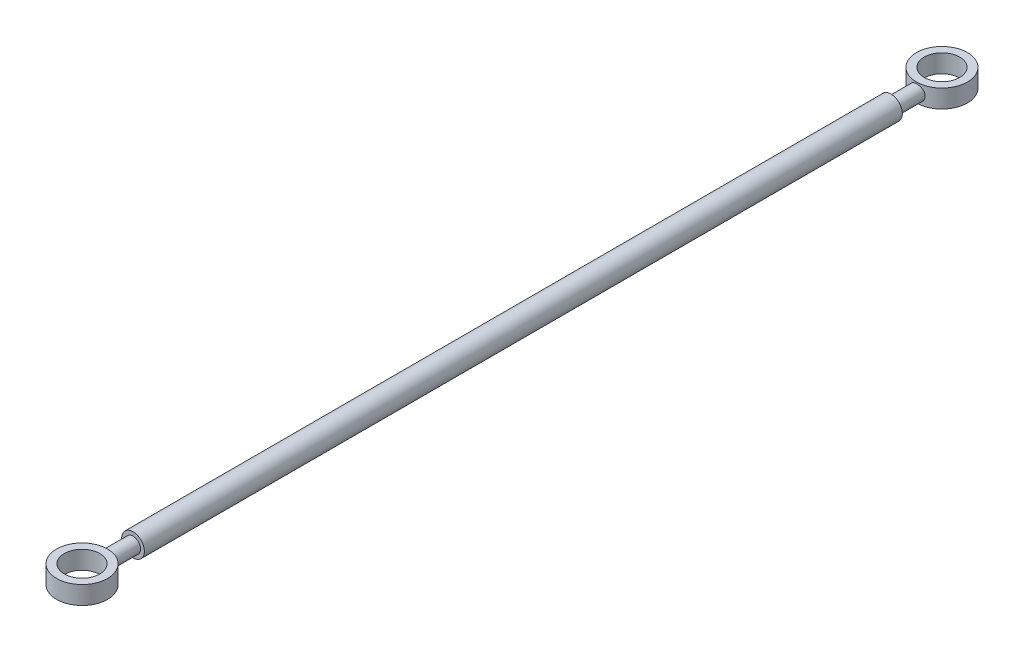
ISO-10303-21;
HEADER;
FILE_DESCRIPTION(('STEP AP214'),'2;1');
FILE_NAME('part.step','',(''),(''),'','','');
FILE_SCHEMA(('AUTOMOTIVE_DESIGN { 1 0 10303 214 1 1 1 1 }'));
ENDSEC;
DATA;
#1=APPLICATION_CONTEXT('core data for automotive mechanical design processes');
#2=APPLICATION_PROTOCOL_DEFINITION('international standard','automotive_design',2000,#1);
#3=PRODUCT_CONTEXT('',#1,'mechanical');
#4=PRODUCT('Part','Part','',(#3));
#5=PRODUCT_RELATED_PRODUCT_CATEGORY('part','',(#4));
#6=PRODUCT_DEFINITION_FORMATION('','',#4);
#7=PRODUCT_DEFINITION_CONTEXT('part definition',#1,'design');
#8=PRODUCT_DEFINITION('design','',#6,#7);
#9=PRODUCT_DEFINITION_SHAPE('','',#8);
#10=(LENGTH_UNIT() NAMED_UNIT(*) SI_UNIT(.MILLI.,.METRE.));
#11=(NAMED_UNIT(*) PLANE_ANGLE_UNIT() SI_UNIT($,.RADIAN.));
#12=(NAMED_UNIT(*) SI_UNIT($,.STERADIAN.) SOLID_ANGLE_UNIT());
#13=UNCERTAINTY_MEASURE_WITH_UNIT(LENGTH_MEASURE(1.E-05),#10,'distance_accuracy_value','');
#14=(GEOMETRIC_REPRESENTATION_CONTEXT(3) GLOBAL_UNCERTAINTY_ASSIGNED_CONTEXT((#13)) GLOBAL_UNIT_ASSIGNED_CONTEXT((#10,
#11,#12)) REPRESENTATION_CONTEXT('',''));
#15=CARTESIAN_POINT('',(0.,0.,0.));
#16=DIRECTION('',(0.,0.,1.));
#17=DIRECTION('',(1.,0.,0.));
#18=AXIS2_PLACEMENT_3D('',#15,#16,#17);
#19=CARTESIAN_POINT('',(0.,0.,5.95000000000001));
#20=DIRECTION('',(0.,0.,1.));
#21=DIRECTION('',(1.,0.,0.));
#22=AXIS2_PLACEMENT_3D('',#19,#20,#21);
#23=CYLINDRICAL_SURFACE('',#22,2.);
#24=CARTESIAN_POINT('',(0.,0.,213.45));
#25=DIRECTION('',(0.,0.,1.));
#26=DIRECTION('',(1.,0.,0.));
#27=AXIS2_PLACEMENT_3D('',#24,#25,#26);
#28=CIRCLE('',#27,2.);
#29=CARTESIAN_POINT('',(2.,0.,213.45));
#30=VERTEX_POINT('',#29);
#31=EDGE_CURVE('E10',#30,#30,#28,.F.);
#32=ORIENTED_EDGE('',*,*,#31,.F.);
#33=EDGE_LOOP('',(#32));
#34=FACE_BOUND('',#33,.T.);
#35=CARTESIAN_POINT('',(2.,0.,220.479281582253));
#36=CARTESIAN_POINT('',(1.99999851560738,0.109640870714026,220.479280366035));
#37=CARTESIAN_POINT('',(1.99095349170802,0.219296457513431,220.476442493243));
#38=CARTESIAN_POINT('',(1.95510353809183,0.435404942564613,220.46544201846));
#39=CARTESIAN_POINT('',(1.92829243842082,0.541856714736717,220.457277566623));
#40=CARTESIAN_POINT('',(1.85789863509272,0.74839798022177,220.43662863254));
#41=CARTESIAN_POINT('',(1.8143434668586,0.8484976063366,220.424151246243));
#42=CARTESIAN_POINT('',(1.71178806605942,1.03999290575109,220.396291888766));
#43=CARTESIAN_POINT('',(1.65278560842055,1.13138732253767,220.380909499229));
#44=CARTESIAN_POINT('',(1.5190460428306,1.30572023299706,220.348436845618));
#45=CARTESIAN_POINT('',(1.44391249598951,1.38834798079452,220.33131067637));
#46=CARTESIAN_POINT('',(1.28089334447942,1.54003606714713,220.297587124875));
#47=CARTESIAN_POINT('',(1.19300613086745,1.60909469129368,220.280989809669));
#48=CARTESIAN_POINT('',(1.00476841709437,1.73302917884108,220.249786772457));
#49=CARTESIAN_POINT('',(0.904201221694222,1.78758884956249,220.235228291808));
#50=CARTESIAN_POINT('',(0.69481291712832,1.87890181413536,220.210160003064));
#51=CARTESIAN_POINT('',(0.58599356142992,1.91565887859552,220.199649337735));
#52=CARTESIAN_POINT('',(0.366440327600565,1.96929673227082,220.184114985807));
#53=CARTESIAN_POINT('',(0.255846520120227,1.98670779177728,220.178945202559));
#54=CARTESIAN_POINT('',(0.0331947451205641,2.00283543386751,220.174160912561));
#55=CARTESIAN_POINT('',(-0.078862915228616,2.00155587741947,220.174545258479));
#56=CARTESIAN_POINT('',(-0.297543781955329,1.98069597961743,220.18072234133));
#57=CARTESIAN_POINT('',(-0.404227300094144,1.96168976313143,220.186345402318));
#58=CARTESIAN_POINT('',(-0.612815719991121,1.90685304982253,220.20216238028));
#59=CARTESIAN_POINT('',(-0.714720320723407,1.87102149472642,220.212356584765));
#60=CARTESIAN_POINT('',(-0.912231161223355,1.78315836788783,220.236406379095));
#61=CARTESIAN_POINT('',(-1.00775132084728,1.7309449285515,220.250302794915));
#62=CARTESIAN_POINT('',(-1.18885875631339,1.61194366841243,220.280281084691));
#63=CARTESIAN_POINT('',(-1.27444370107462,1.54515243779459,220.296363469622));
#64=CARTESIAN_POINT('',(-1.43667782212152,1.39590804115211,220.329710381038));
#65=CARTESIAN_POINT('',(-1.51286524763986,1.31295712424591,220.346996609429));
#66=CARTESIAN_POINT('',(-1.65037709434811,1.13528671287647,220.380268485835));
#67=CARTESIAN_POINT('',(-1.7117000910596,1.04056609182112,220.396254009104));
#68=CARTESIAN_POINT('',(-1.81821284350666,0.84084712084729,220.425216983731));
#69=CARTESIAN_POINT('',(-1.86324759780941,0.735761548860513,220.438165142782));
#70=CARTESIAN_POINT('',(-1.93484578229086,0.519023963553533,220.4592387343));
#71=CARTESIAN_POINT('',(-1.96141511599137,0.407374061287613,220.467365708012));
#72=CARTESIAN_POINT('',(-1.99447071211371,0.185065651450187,220.477539287428));
#73=CARTESIAN_POINT('',(-2.0016578148627,0.0745209720808633,220.479797968749));
#74=CARTESIAN_POINT('',(-1.99769994538114,-0.146197373587287,220.478565161083));
#75=CARTESIAN_POINT('',(-1.9865574864935,-0.25637108867696,220.475074460447));
#76=CARTESIAN_POINT('',(-1.94688045721304,-0.470315540046707,220.462944088212));
#77=CARTESIAN_POINT('',(-1.91879476281874,-0.574177829067012,220.454437431091));
#78=CARTESIAN_POINT('',(-1.84654768916541,-0.775709655385415,220.433370801785));
#79=CARTESIAN_POINT('',(-1.80238385719349,-0.873378245166763,220.420810211208));
#80=CARTESIAN_POINT('',(-1.69789727502947,-1.0626072968666,220.39263776731));
#81=CARTESIAN_POINT('',(-1.63717792174735,-1.15393779062483,220.376953978789));
#82=CARTESIAN_POINT('',(-1.50177654125562,-1.32536954846293,220.34445799054));
#83=CARTESIAN_POINT('',(-1.42709123044719,-1.40546816399984,220.327645526041));
#84=CARTESIAN_POINT('',(-1.26258732798229,-1.55521508114858,220.294033733161));
#85=CARTESIAN_POINT('',(-1.17231107986877,-1.62436711855155,220.277257903056));
#86=CARTESIAN_POINT('',(-0.981037336420591,-1.74655124272971,220.246236886566));
#87=CARTESIAN_POINT('',(-0.880040380408562,-1.79958413988639,220.231991572975));
#88=CARTESIAN_POINT('',(-0.670866929999853,-1.88751327306857,220.2077244725));
#89=CARTESIAN_POINT('',(-0.562751460230838,-1.92254552922692,220.197671121849));
#90=CARTESIAN_POINT('',(-0.341816042583998,-1.97383197269679,220.182781283523));
#91=CARTESIAN_POINT('',(-0.228997424541737,-1.99009143128261,220.177943331426));
#92=CARTESIAN_POINT('',(-0.00644828098169629,-2.0029755013884,220.174116930849));
#93=CARTESIAN_POINT('',(0.103237378208294,-2.00032041702638,220.174913884834));
#94=CARTESIAN_POINT('',(0.320532326668108,-1.97716864485407,220.181763637534));
#95=CARTESIAN_POINT('',(0.428141729855648,-1.95667293876499,220.187816147051));
#96=CARTESIAN_POINT('',(0.637142716306885,-1.89886466785401,220.20443721168));
#97=CARTESIAN_POINT('',(0.738587299967468,-1.8617291029875,220.214958175482));
#98=CARTESIAN_POINT('',(0.933859556384472,-1.77185335986215,220.239427506763));
#99=CARTESIAN_POINT('',(1.02768598670588,-1.71911064274097,220.253376431816));
#100=CARTESIAN_POINT('',(1.20827942056772,-1.59758502717247,220.28378196905));
#101=CARTESIAN_POINT('',(1.29472978502124,-1.5283480530679,220.300303879013));
#102=CARTESIAN_POINT('',(1.45502611913537,-1.37662053024966,220.333780183405));
#103=CARTESIAN_POINT('',(1.52886847405531,-1.29412619374,220.350734700267));
#104=CARTESIAN_POINT('',(1.66401147958099,-1.11534009923823,220.383737288877));
#105=CARTESIAN_POINT('',(1.72488397859197,-1.01871634220365,220.399744551877));
#106=CARTESIAN_POINT('',(1.8294484230846,-0.816146374987869,220.428392775536));
#107=CARTESIAN_POINT('',(1.87314888184387,-0.710204816199572,220.441035403254));
#108=CARTESIAN_POINT('',(1.93804172805924,-0.504286981297851,220.460230457429));
#109=CARTESIAN_POINT('',(1.96121288015267,-0.404979997528448,220.467307944032));
#110=CARTESIAN_POINT('',(1.99219123113458,-0.203785913515372,220.476833627253));
#111=CARTESIAN_POINT('',(2.00000137958214,-0.101899312406011,220.479282712595));
#112=CARTESIAN_POINT('',(2.,0.,220.479281582253));
#113=B_SPLINE_CURVE_WITH_KNOTS('',3,(#35,#36,#37,#38,#39,#40,#41,#42,#43,#44,#45,#46,#47,#48,
#49,#50,#51,#52,#53,#54,#55,#56,#57,#58,#59,#60,#61,#62,#63,#64,#65,#66,#67,#68,#69,#70,#71,#72,
#73,#74,#75,#76,#77,#78,#79,#80,#81,#82,#83,#84,#85,#86,#87,#88,#89,#90,#91,#92,#93,#94,#95,#96,
#97,#98,#99,#100,#101,#102,#103,#104,#105,#106,#107,#108,#109,#110,#111,#112),.UNSPECIFIED.,.T.,
.F.,(4,2,2,2,2,2,2,2,2,2,2,2,2,2,2,2,2,2,2,2,2,2,2,2,2,2,2,2,2,2,2,2,2,2,2,2,2,2,4),(0.,
0.328546821910681,0.657207804203182,0.985330603552502,1.31350069272135,1.65091573328383,
1.98837337761497,2.33267792085341,2.67690950814201,3.01145329080327,3.34592796687985,
3.66993255325425,3.99395752146592,4.32171522827139,4.64954968148883,4.98981225024137,
5.33010741393815,5.67356059395358,6.01690391905364,6.34765454228637,6.67835981689266,
7.00066650900189,7.32302238947337,7.65390684119928,7.98486918668786,8.32807607980909,
8.6712657155248,9.01182245656161,9.35228354830027,9.67985043963615,10.0073993069907,
10.3315437973062,10.6557410461942,10.9901796802721,11.3247140381321,11.6689964067162,
12.0131078765363,12.3185152062754,12.6238638871811),.UNSPECIFIED.);
#114=CARTESIAN_POINT('',(2.,0.,220.479281582253));
#115=VERTEX_POINT('',#114);
#116=EDGE_CURVE('E38',#115,#115,#113,.T.);
#117=ORIENTED_EDGE('',*,*,#116,.F.);
#118=EDGE_LOOP('',(#117));
#119=FACE_BOUND('',#118,.T.);
#120=ADVANCED_FACE('F30',(#34,#119),#23,.T.);
#121=CARTESIAN_POINT('',(0.,2.4,226.9));
#122=DIRECTION('',(0.,-1.,0.));
#123=DIRECTION('',(0.,0.,-1.));
#124=AXIS2_PLACEMENT_3D('',#121,#122,#123);
#125=CYLINDRICAL_SURFACE('',#124,6.725);
#126=ORIENTED_EDGE('',*,*,#116,.T.);
#127=EDGE_LOOP('',(#126));
#128=FACE_BOUND('',#127,.T.);
#129=CARTESIAN_POINT('',(0.,2.4,226.9));
#130=DIRECTION('',(0.,-1.,0.));
#131=DIRECTION('',(0.,0.,-1.));
#132=AXIS2_PLACEMENT_3D('',#129,#130,#131);
#133=CIRCLE('',#132,6.725);
#134=CARTESIAN_POINT('',(0.,2.4,220.175));
#135=VERTEX_POINT('',#134);
#136=EDGE_CURVE('E124',#135,#135,#133,.T.);
#137=ORIENTED_EDGE('',*,*,#136,.T.);
#138=EDGE_LOOP('',(#137));
#139=FACE_BOUND('',#138,.T.);
#140=CARTESIAN_POINT('',(0.,-2.4,226.9));
#141=DIRECTION('',(0.,-1.,0.));
#142=DIRECTION('',(0.,0.,-1.));
#143=AXIS2_PLACEMENT_3D('',#140,#141,#142);
#144=CIRCLE('',#143,6.725);
#145=CARTESIAN_POINT('',(0.,-2.4,220.175));
#146=VERTEX_POINT('',#145);
#147=EDGE_CURVE('E122',#146,#146,#144,.T.);
#148=ORIENTED_EDGE('',*,*,#147,.F.);
#149=EDGE_LOOP('',(#148));
#150=FACE_BOUND('',#149,.T.);
#151=ADVANCED_FACE('F61',(#128,#139,#150),#125,.T.);
#152=CARTESIAN_POINT('',(0.,2.4,226.9));
#153=DIRECTION('',(0.,1.,0.));
#154=DIRECTION('',(0.,0.,-1.));
#155=AXIS2_PLACEMENT_3D('',#152,#153,#154);
#156=PLANE('',#155);
#157=CARTESIAN_POINT('',(0.,2.4,226.9));
#158=DIRECTION('',(0.,-1.,0.));
#159=DIRECTION('',(0.,0.,-1.));
#160=AXIS2_PLACEMENT_3D('',#157,#158,#159);
#161=CIRCLE('',#160,4.68);
#162=CARTESIAN_POINT('',(0.,2.4,222.22));
#163=VERTEX_POINT('',#162);
#164=EDGE_CURVE('E112',#163,#163,#161,.T.);
#165=ORIENTED_EDGE('',*,*,#164,.T.);
#166=EDGE_LOOP('',(#165));
#167=FACE_BOUND('',#166,.T.);
#168=ORIENTED_EDGE('',*,*,#136,.F.);
#169=EDGE_LOOP('',(#168));
#170=FACE_BOUND('',#169,.T.);
#171=ADVANCED_FACE('F65',(#167,#170),#156,.T.);
#172=CARTESIAN_POINT('',(0.,-2.4,226.9));
#173=DIRECTION('',(0.,1.,0.));
#174=DIRECTION('',(0.,0.,-1.));
#175=AXIS2_PLACEMENT_3D('',#172,#173,#174);
#176=PLANE('',#175);
#177=CARTESIAN_POINT('',(0.,-2.4,226.9));
#178=DIRECTION('',(0.,-1.,0.));
#179=DIRECTION('',(0.,0.,-1.));
#180=AXIS2_PLACEMENT_3D('',#177,#178,#179);
#181=CIRCLE('',#180,4.68);
#182=CARTESIAN_POINT('',(0.,-2.4,222.22));
#183=VERTEX_POINT('',#182);
#184=EDGE_CURVE('E109',#183,#183,#181,.T.);
#185=ORIENTED_EDGE('',*,*,#184,.F.);
#186=EDGE_LOOP('',(#185));
#187=FACE_BOUND('',#186,.T.);
#188=ORIENTED_EDGE('',*,*,#147,.T.);
#189=EDGE_LOOP('',(#188));
#190=FACE_BOUND('',#189,.T.);
#191=ADVANCED_FACE('F66',(#187,#190),#176,.F.);
#192=CARTESIAN_POINT('',(0.,2.4,226.9));
#193=DIRECTION('',(0.,-1.,0.));
#194=DIRECTION('',(0.,0.,-1.));
#195=AXIS2_PLACEMENT_3D('',#192,#193,#194);
#196=CYLINDRICAL_SURFACE('',#195,4.68);
#197=ORIENTED_EDGE('',*,*,#164,.F.);
#198=EDGE_LOOP('',(#197));
#199=FACE_BOUND('',#198,.T.);
#200=ORIENTED_EDGE('',*,*,#184,.T.);
#201=EDGE_LOOP('',(#200));
#202=FACE_BOUND('',#201,.T.);
#203=ADVANCED_FACE('F69',(#199,#202),#196,.F.);
#204=CARTESIAN_POINT('',(0.,0.,213.45));
#205=DIRECTION('',(0.,0.,-1.));
#206=DIRECTION('',(-1.,0.,0.));
#207=AXIS2_PLACEMENT_3D('',#204,#205,#206);
#208=CYLINDRICAL_SURFACE('',#207,3.);
#209=CARTESIAN_POINT('',(0.,0.,213.45));
#210=DIRECTION('',(0.,0.,1.));
#211=DIRECTION('',(1.,0.,0.));
#212=AXIS2_PLACEMENT_3D('',#209,#210,#211);
#213=CIRCLE('',#212,3.);
#214=CARTESIAN_POINT('',(3.,0.,213.45));
#215=VERTEX_POINT('',#214);
#216=EDGE_CURVE('E110',#215,#215,#213,.T.);
#217=ORIENTED_EDGE('',*,*,#216,.F.);
#218=EDGE_LOOP('',(#217));
#219=FACE_BOUND('',#218,.T.);
#220=CARTESIAN_POINT('',(0.,0.,13.45));
#221=DIRECTION('',(0.,0.,1.));
#222=DIRECTION('',(1.,0.,0.));
#223=AXIS2_PLACEMENT_3D('',#220,#221,#222);
#224=CIRCLE('',#223,3.);
#225=CARTESIAN_POINT('',(3.,0.,13.45));
#226=VERTEX_POINT('',#225);
#227=EDGE_CURVE('E115',#226,#226,#224,.T.);
#228=ORIENTED_EDGE('',*,*,#227,.T.);
#229=EDGE_LOOP('',(#228));
#230=FACE_BOUND('',#229,.T.);
#231=ADVANCED_FACE('F76',(#219,#230),#208,.T.);
#232=CARTESIAN_POINT('',(0.,0.,213.45));
#233=DIRECTION('',(0.,0.,1.));
#234=DIRECTION('',(1.,0.,0.));
#235=AXIS2_PLACEMENT_3D('',#232,#233,#234);
#236=PLANE('',#235);
#237=ORIENTED_EDGE('',*,*,#31,.T.);
#238=EDGE_LOOP('',(#237));
#239=FACE_BOUND('',#238,.T.);
#240=ORIENTED_EDGE('',*,*,#216,.T.);
#241=EDGE_LOOP('',(#240));
#242=FACE_BOUND('',#241,.T.);
#243=ADVANCED_FACE('F80',(#239,#242),#236,.T.);
#244=CARTESIAN_POINT('',(0.,0.,13.45));
#245=DIRECTION('',(0.,0.,1.));
#246=DIRECTION('',(1.,0.,0.));
#247=AXIS2_PLACEMENT_3D('',#244,#245,#246);
#248=PLANE('',#247);
#249=CARTESIAN_POINT('',(0.,0.,13.45));
#250=DIRECTION('',(0.,0.,1.));
#251=DIRECTION('',(1.,0.,0.));
#252=AXIS2_PLACEMENT_3D('',#249,#250,#251);
#253=CIRCLE('',#252,2.);
#254=CARTESIAN_POINT('',(2.,0.,13.45));
#255=VERTEX_POINT('',#254);
#256=EDGE_CURVE('E58',#255,#255,#253,.F.);
#257=ORIENTED_EDGE('',*,*,#256,.F.);
#258=EDGE_LOOP('',(#257));
#259=FACE_BOUND('',#258,.T.);
#260=ORIENTED_EDGE('',*,*,#227,.F.);
#261=EDGE_LOOP('',(#260));
#262=FACE_BOUND('',#261,.T.);
#263=ADVANCED_FACE('F82',(#259,#262),#248,.F.);
#264=CARTESIAN_POINT('',(0.,2.4,0.));
#265=DIRECTION('',(0.,-1.,0.));
#266=DIRECTION('',(0.,0.,-1.));
#267=AXIS2_PLACEMENT_3D('',#264,#265,#266);
#268=CYLINDRICAL_SURFACE('',#267,4.68);
#269=CARTESIAN_POINT('',(0.,2.4,0.));
#270=DIRECTION('',(0.,1.,0.));
#271=DIRECTION('',(0.,0.,1.));
#272=AXIS2_PLACEMENT_3D('',#269,#270,#271);
#273=CIRCLE('',#272,4.68);
#274=CARTESIAN_POINT('',(0.,2.4,4.68));
#275=VERTEX_POINT('',#274);
#276=EDGE_CURVE('E129',#275,#275,#273,.T.);
#277=ORIENTED_EDGE('',*,*,#276,.T.);
#278=EDGE_LOOP('',(#277));
#279=FACE_BOUND('',#278,.T.);
#280=CARTESIAN_POINT('',(0.,-2.4,0.));
#281=DIRECTION('',(0.,1.,0.));
#282=DIRECTION('',(0.,0.,1.));
#283=AXIS2_PLACEMENT_3D('',#280,#281,#282);
#284=CIRCLE('',#283,4.68);
#285=CARTESIAN_POINT('',(0.,-2.4,4.68));
#286=VERTEX_POINT('',#285);
#287=EDGE_CURVE('E132',#286,#286,#284,.T.);
#288=ORIENTED_EDGE('',*,*,#287,.F.);
#289=EDGE_LOOP('',(#288));
#290=FACE_BOUND('',#289,.T.);
#291=ADVANCED_FACE('F85',(#279,#290),#268,.F.);
#292=CARTESIAN_POINT('',(0.,-2.4,0.));
#293=DIRECTION('',(0.,1.,0.));
#294=DIRECTION('',(0.,0.,1.));
#295=AXIS2_PLACEMENT_3D('',#292,#293,#294);
#296=PLANE('',#295);
#297=CARTESIAN_POINT('',(0.,-2.4,0.));
#298=DIRECTION('',(0.,1.,0.));
#299=DIRECTION('',(0.,0.,1.));
#300=AXIS2_PLACEMENT_3D('',#297,#298,#299);
#301=CIRCLE('',#300,6.725);
#302=CARTESIAN_POINT('',(0.,-2.4,6.725));
#303=VERTEX_POINT('',#302);
#304=EDGE_CURVE('E47',#303,#303,#301,.T.);
#305=ORIENTED_EDGE('',*,*,#304,.F.);
#306=EDGE_LOOP('',(#305));
#307=FACE_BOUND('',#306,.T.);
#308=ORIENTED_EDGE('',*,*,#287,.T.);
#309=EDGE_LOOP('',(#308));
#310=FACE_BOUND('',#309,.T.);
#311=ADVANCED_FACE('F138',(#307,#310),#296,.F.);
#312=CARTESIAN_POINT('',(0.,2.4,0.));
#313=DIRECTION('',(0.,1.,0.));
#314=DIRECTION('',(0.,0.,1.));
#315=AXIS2_PLACEMENT_3D('',#312,#313,#314);
#316=PLANE('',#315);
#317=CARTESIAN_POINT('',(0.,2.4,0.));
#318=DIRECTION('',(0.,1.,0.));
#319=DIRECTION('',(0.,0.,1.));
#320=AXIS2_PLACEMENT_3D('',#317,#318,#319);
#321=CIRCLE('',#320,6.725);
#322=CARTESIAN_POINT('',(0.,2.4,6.725));
#323=VERTEX_POINT('',#322);
#324=EDGE_CURVE('E42',#323,#323,#321,.T.);
#325=ORIENTED_EDGE('',*,*,#324,.T.);
#326=EDGE_LOOP('',(#325));
#327=FACE_BOUND('',#326,.T.);
#328=ORIENTED_EDGE('',*,*,#276,.F.);
#329=EDGE_LOOP('',(#328));
#330=FACE_BOUND('',#329,.T.);
#331=ADVANCED_FACE('F102',(#327,#330),#316,.T.);
#332=CARTESIAN_POINT('',(0.,2.4,0.));
#333=DIRECTION('',(0.,-1.,0.));
#334=DIRECTION('',(0.,0.,-1.));
#335=AXIS2_PLACEMENT_3D('',#332,#333,#334);
#336=CYLINDRICAL_SURFACE('',#335,6.725);
#337=CARTESIAN_POINT('',(2.,0.,6.42071841774735));
#338=CARTESIAN_POINT('',(1.99999851560738,-0.109640870714025,6.42071963396486));
#339=CARTESIAN_POINT('',(1.99095349170802,-0.21929645751343,6.4235575067565));
#340=CARTESIAN_POINT('',(1.95510353809183,-0.435404942564612,6.4345579815401));
#341=CARTESIAN_POINT('',(1.92829243842082,-0.541856714736716,6.4427224333766));
#342=CARTESIAN_POINT('',(1.85789863509272,-0.74839798022177,6.46337136745985));
#343=CARTESIAN_POINT('',(1.8143434668586,-0.848497606336604,6.47584875375686));
#344=CARTESIAN_POINT('',(1.71178806605942,-1.03999290575109,6.50370811123425));
#345=CARTESIAN_POINT('',(1.65278560842054,-1.13138732253767,6.51909050077097));
#346=CARTESIAN_POINT('',(1.5190460428306,-1.30572023299707,6.55156315438238));
#347=CARTESIAN_POINT('',(1.44391249598951,-1.38834798079452,6.5686893236298));
#348=CARTESIAN_POINT('',(1.28089334447941,-1.54003606714713,6.60241287512453));
#349=CARTESIAN_POINT('',(1.19300613086745,-1.60909469129369,6.61901019033142));
#350=CARTESIAN_POINT('',(1.00476841709437,-1.73302917884108,6.65021322754287));
#351=CARTESIAN_POINT('',(0.904201221694223,-1.78758884956249,6.6647717081922));
#352=CARTESIAN_POINT('',(0.694812917128323,-1.87890181413536,6.68983999693603));
#353=CARTESIAN_POINT('',(0.585993561429921,-1.91565887859551,6.70035066226491));
#354=CARTESIAN_POINT('',(0.366440327600566,-1.96929673227082,6.71588501419302));
#355=CARTESIAN_POINT('',(0.255846520120227,-1.98670779177728,6.72105479744062));
#356=CARTESIAN_POINT('',(0.033194745120564,-2.00283543386751,6.72583908743936));
#357=CARTESIAN_POINT('',(-0.0788629152286166,-2.00155587741947,6.7254547415213));
#358=CARTESIAN_POINT('',(-0.29754378195533,-1.98069597961743,6.71927765866968));
#359=CARTESIAN_POINT('',(-0.404227300094145,-1.96168976313143,6.71365459768178));
#360=CARTESIAN_POINT('',(-0.612815719991122,-1.90685304982253,6.69783761972046));
#361=CARTESIAN_POINT('',(-0.714720320723408,-1.87102149472642,6.68764341523496));
#362=CARTESIAN_POINT('',(-0.912231161223356,-1.78315836788783,6.66359362090468));
#363=CARTESIAN_POINT('',(-1.00775132084728,-1.7309449285515,6.6496972050846));
#364=CARTESIAN_POINT('',(-1.18885875631339,-1.61194366841243,6.61971891530944));
#365=CARTESIAN_POINT('',(-1.27444370107462,-1.54515243779459,6.60363653037829));
#366=CARTESIAN_POINT('',(-1.43667782212152,-1.39590804115211,6.57028961896218));
#367=CARTESIAN_POINT('',(-1.51286524763986,-1.31295712424591,6.55300339057145));
#368=CARTESIAN_POINT('',(-1.65037709434811,-1.13528671287647,6.51973151416523));
#369=CARTESIAN_POINT('',(-1.7117000910596,-1.04056609182112,6.50374599089551));
#370=CARTESIAN_POINT('',(-1.81821284350666,-0.840847120847291,6.47478301626949));
#371=CARTESIAN_POINT('',(-1.86324759780941,-0.735761548860516,6.46183485721795));
#372=CARTESIAN_POINT('',(-1.93484578229086,-0.519023963553537,6.44076126569951));
#373=CARTESIAN_POINT('',(-1.96141511599137,-0.407374061287614,6.4326342919883));
#374=CARTESIAN_POINT('',(-1.99447071211371,-0.185065651450186,6.42246071257172));
#375=CARTESIAN_POINT('',(-2.0016578148627,-0.0745209720808615,6.4202020312505));
#376=CARTESIAN_POINT('',(-1.99769994538114,0.146197373587289,6.42143483891747));
#377=CARTESIAN_POINT('',(-1.9865574864935,0.256371088676962,6.42492553955255));
#378=CARTESIAN_POINT('',(-1.94688045721304,0.47031554004671,6.4370559117876));
#379=CARTESIAN_POINT('',(-1.91879476281874,0.574177829067015,6.44556256890921));
#380=CARTESIAN_POINT('',(-1.8465476891654,0.775709655385419,6.46662919821491));
#381=CARTESIAN_POINT('',(-1.80238385719348,0.873378245166766,6.4791897887916));
#382=CARTESIAN_POINT('',(-1.69789727502947,1.0626072968666,6.50736223269043));
#383=CARTESIAN_POINT('',(-1.63717792174735,1.15393779062483,6.52304602121144));
#384=CARTESIAN_POINT('',(-1.50177654125562,1.32536954846293,6.55554200946026));
#385=CARTESIAN_POINT('',(-1.42709123044719,1.40546816399984,6.57235447395906));
#386=CARTESIAN_POINT('',(-1.26258732798228,1.55521508114858,6.60596626683931));
#387=CARTESIAN_POINT('',(-1.17231107986877,1.62436711855156,6.62274209694385));
#388=CARTESIAN_POINT('',(-0.981037336420583,1.74655124272971,6.65376311343411));
#389=CARTESIAN_POINT('',(-0.880040380408555,1.7995841398864,6.66800842702529));
#390=CARTESIAN_POINT('',(-0.670866929999849,1.88751327306858,6.69227552749999));
#391=CARTESIAN_POINT('',(-0.562751460230836,1.92254552922692,6.70232887815126));
#392=CARTESIAN_POINT('',(-0.341816042583996,1.97383197269679,6.71721871647686));
#393=CARTESIAN_POINT('',(-0.228997424541735,1.99009143128261,6.72205666857442));
#394=CARTESIAN_POINT('',(-0.00644828098169397,2.0029755013884,6.72588306915083));
#395=CARTESIAN_POINT('',(0.103237378208296,2.00032041702638,6.72508611516625));
#396=CARTESIAN_POINT('',(0.32053232666811,1.97716864485407,6.71823636246605));
#397=CARTESIAN_POINT('',(0.428141729855651,1.95667293876499,6.71218385294951));
#398=CARTESIAN_POINT('',(0.637142716306889,1.89886466785401,6.69556278831966));
#399=CARTESIAN_POINT('',(0.738587299967471,1.8617291029875,6.68504182451771));
#400=CARTESIAN_POINT('',(0.933859556384475,1.77185335986215,6.6605724932367));
#401=CARTESIAN_POINT('',(1.02768598670589,1.71911064274097,6.64662356818352));
#402=CARTESIAN_POINT('',(1.20827942056772,1.59758502717247,6.6162180309499));
#403=CARTESIAN_POINT('',(1.29472978502124,1.5283480530679,6.59969612098697));
#404=CARTESIAN_POINT('',(1.45502611913537,1.37662053024966,6.56621981659491));
#405=CARTESIAN_POINT('',(1.52886847405531,1.29412619374,6.54926529973261));
#406=CARTESIAN_POINT('',(1.66401147958099,1.11534009923823,6.51626271112317));
#407=CARTESIAN_POINT('',(1.72488397859197,1.01871634220365,6.5002554481235));
#408=CARTESIAN_POINT('',(1.8294484230846,0.816146374987871,6.47160722446416));
#409=CARTESIAN_POINT('',(1.87314888184387,0.710204816199572,6.45896459674564));
#410=CARTESIAN_POINT('',(1.93804172805924,0.504286981297851,6.4397695425711));
#411=CARTESIAN_POINT('',(1.96121288015267,0.404979997528449,6.43269205596782));
#412=CARTESIAN_POINT('',(1.99219123113458,0.203785913515373,6.4231663727466));
#413=CARTESIAN_POINT('',(2.00000137958214,0.101899312406011,6.42071728740491));
#414=CARTESIAN_POINT('',(2.,0.,6.42071841774735));
#415=B_SPLINE_CURVE_WITH_KNOTS('',3,(#337,#338,#339,#340,#341,#342,#343,#344,#345,#346,#347,
#348,#349,#350,#351,#352,#353,#354,#355,#356,#357,#358,#359,#360,#361,#362,#363,#364,#365,#366,
#367,#368,#369,#370,#371,#372,#373,#374,#375,#376,#377,#378,#379,#380,#381,#382,#383,#384,#385,
#386,#387,#388,#389,#390,#391,#392,#393,#394,#395,#396,#397,#398,#399,#400,#401,#402,#403,#404,
#405,#406,#407,#408,#409,#410,#411,#412,#413,#414),.UNSPECIFIED.,.T.,.F.,(4,2,2,2,2,2,2,2,2,2,2,
2,2,2,2,2,2,2,2,2,2,2,2,2,2,2,2,2,2,2,2,2,2,2,2,2,2,2,4),(0.,0.328546821910679,
0.657207804203183,0.985330603552508,1.31350069272135,1.65091573328383,1.98837337761497,
2.33267792085341,2.67690950814201,3.01145329080327,3.34592796687985,3.66993255325425,
3.99395752146592,4.32171522827139,4.64954968148883,4.98981225024136,5.33010741393815,
5.67356059395358,6.01690391905364,6.34765454228637,6.67835981689267,7.0006665090019,
7.32302238947338,7.65390684119928,7.98486918668786,8.3280760798091,8.6712657155248,
9.01182245656161,9.35228354830027,9.67985043963615,10.0073993069907,10.3315437973062,
10.6557410461942,10.9901796802721,11.3247140381321,11.6689964067162,12.0131078765363,
12.3185152062754,12.6238638871811),.UNSPECIFIED.);
#416=CARTESIAN_POINT('',(2.,0.,6.42071841774735));
#417=VERTEX_POINT('',#416);
#418=EDGE_CURVE('E54',#417,#417,#415,.T.);
#419=ORIENTED_EDGE('',*,*,#418,.T.);
#420=EDGE_LOOP('',(#419));
#421=FACE_BOUND('',#420,.T.);
#422=ORIENTED_EDGE('',*,*,#324,.F.);
#423=EDGE_LOOP('',(#422));
#424=FACE_BOUND('',#423,.T.);
#425=ORIENTED_EDGE('',*,*,#304,.T.);
#426=EDGE_LOOP('',(#425));
#427=FACE_BOUND('',#426,.T.);
#428=ADVANCED_FACE('F32',(#421,#424,#427),#336,.T.);
#429=ORIENTED_EDGE('',*,*,#418,.F.);
#430=EDGE_LOOP('',(#429));
#431=FACE_BOUND('',#430,.T.);
#432=ORIENTED_EDGE('',*,*,#256,.T.);
#433=EDGE_LOOP('',(#432));
#434=FACE_BOUND('',#433,.T.);
#435=ADVANCED_FACE('F93',(#431,#434),#23,.T.);
#436=CLOSED_SHELL('',(#120,#151,#171,#191,#203,#231,#243,#263,#291,#311,#331,#428,#435));
#437=MANIFOLD_SOLID_BREP('B2',#436);
#438=ADVANCED_BREP_SHAPE_REPRESENTATION('',(#18,#437),#14);
#439=SHAPE_DEFINITION_REPRESENTATION(#9,#438);
ENDSEC;
END-ISO-10303-21;
